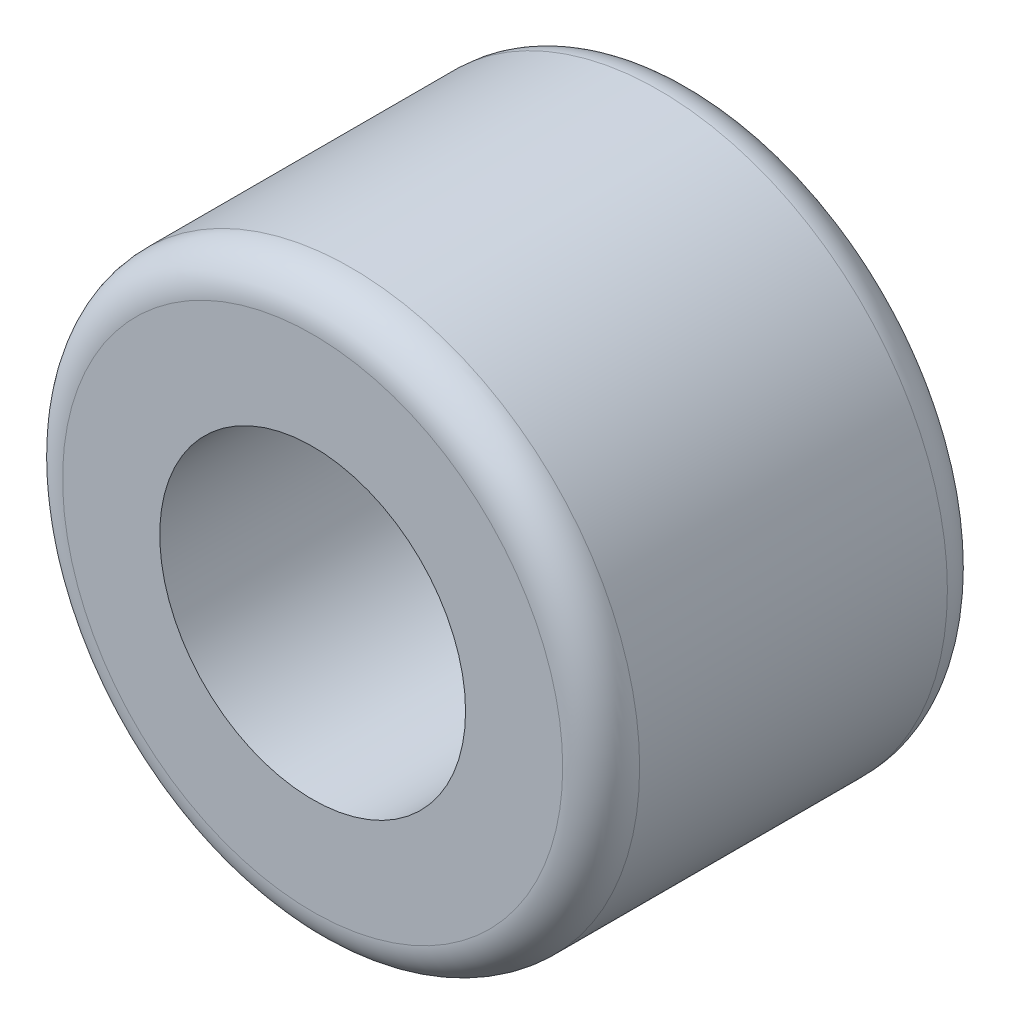
ISO-10303-21;
HEADER;
FILE_DESCRIPTION(('STEP AP214'),'2;1');
FILE_NAME('part.step','',(''),(''),'','','');
FILE_SCHEMA(('AUTOMOTIVE_DESIGN { 1 0 10303 214 1 1 1 1 }'));
ENDSEC;
DATA;
#1=APPLICATION_CONTEXT('core data for automotive mechanical design processes');
#2=APPLICATION_PROTOCOL_DEFINITION('international standard','automotive_design',2000,#1);
#3=PRODUCT_CONTEXT('',#1,'mechanical');
#4=PRODUCT('Part','Part','',(#3));
#5=PRODUCT_RELATED_PRODUCT_CATEGORY('part','',(#4));
#6=PRODUCT_DEFINITION_FORMATION('','',#4);
#7=PRODUCT_DEFINITION_CONTEXT('part definition',#1,'design');
#8=PRODUCT_DEFINITION('design','',#6,#7);
#9=PRODUCT_DEFINITION_SHAPE('','',#8);
#10=(LENGTH_UNIT() NAMED_UNIT(*) SI_UNIT(.MILLI.,.METRE.));
#11=(NAMED_UNIT(*) PLANE_ANGLE_UNIT() SI_UNIT($,.RADIAN.));
#12=(NAMED_UNIT(*) SI_UNIT($,.STERADIAN.) SOLID_ANGLE_UNIT());
#13=UNCERTAINTY_MEASURE_WITH_UNIT(LENGTH_MEASURE(1.E-05),#10,'distance_accuracy_value','');
#14=(GEOMETRIC_REPRESENTATION_CONTEXT(3) GLOBAL_UNCERTAINTY_ASSIGNED_CONTEXT((#13)) GLOBAL_UNIT_ASSIGNED_CONTEXT((#10,
#11,#12)) REPRESENTATION_CONTEXT('',''));
#15=CARTESIAN_POINT('',(0.,0.,0.));
#16=DIRECTION('',(0.,0.,1.));
#17=DIRECTION('',(1.,0.,0.));
#18=AXIS2_PLACEMENT_3D('',#15,#16,#17);
#19=CARTESIAN_POINT('',(0.,0.,5.));
#20=DIRECTION('',(0.,0.,1.));
#21=DIRECTION('',(1.,0.,0.));
#22=AXIS2_PLACEMENT_3D('',#19,#20,#21);
#23=PLANE('',#22);
#24=CARTESIAN_POINT('',(0.,0.,5.));
#25=DIRECTION('',(0.,0.,1.));
#26=DIRECTION('',(1.,0.,0.));
#27=AXIS2_PLACEMENT_3D('',#24,#25,#26);
#28=CIRCLE('',#27,6.5);
#29=CARTESIAN_POINT('',(6.5,0.,5.));
#30=VERTEX_POINT('',#29);
#31=EDGE_CURVE('E60',#30,#30,#28,.T.);
#32=ORIENTED_EDGE('',*,*,#31,.T.);
#33=EDGE_LOOP('',(#32));
#34=FACE_BOUND('',#33,.T.);
#35=CARTESIAN_POINT('',(0.,0.,5.));
#36=DIRECTION('',(0.,0.,1.));
#37=DIRECTION('',(1.,0.,0.));
#38=AXIS2_PLACEMENT_3D('',#35,#36,#37);
#39=CIRCLE('',#38,3.975);
#40=CARTESIAN_POINT('',(3.975,0.,5.));
#41=VERTEX_POINT('',#40);
#42=EDGE_CURVE('E66',#41,#41,#39,.T.);
#43=ORIENTED_EDGE('',*,*,#42,.F.);
#44=EDGE_LOOP('',(#43));
#45=FACE_BOUND('',#44,.T.);
#46=ADVANCED_FACE('F42',(#34,#45),#23,.T.);
#47=CARTESIAN_POINT('',(0.,0.,-5.));
#48=DIRECTION('',(0.,0.,1.));
#49=DIRECTION('',(1.,0.,0.));
#50=AXIS2_PLACEMENT_3D('',#47,#48,#49);
#51=PLANE('',#50);
#52=CARTESIAN_POINT('',(0.,0.,-5.));
#53=DIRECTION('',(0.,0.,1.));
#54=DIRECTION('',(1.,0.,0.));
#55=AXIS2_PLACEMENT_3D('',#52,#53,#54);
#56=CIRCLE('',#55,6.5);
#57=CARTESIAN_POINT('',(6.5,0.,-5.));
#58=VERTEX_POINT('',#57);
#59=EDGE_CURVE('E10',#58,#58,#56,.F.);
#60=ORIENTED_EDGE('',*,*,#59,.T.);
#61=EDGE_LOOP('',(#60));
#62=FACE_BOUND('',#61,.T.);
#63=CARTESIAN_POINT('',(0.,0.,-5.));
#64=DIRECTION('',(0.,0.,1.));
#65=DIRECTION('',(1.,0.,0.));
#66=AXIS2_PLACEMENT_3D('',#63,#64,#65);
#67=CIRCLE('',#66,3.975);
#68=CARTESIAN_POINT('',(3.975,0.,-5.));
#69=VERTEX_POINT('',#68);
#70=EDGE_CURVE('E67',#69,#69,#67,.T.);
#71=ORIENTED_EDGE('',*,*,#70,.T.);
#72=EDGE_LOOP('',(#71));
#73=FACE_BOUND('',#72,.T.);
#74=ADVANCED_FACE('F79',(#62,#73),#51,.F.);
#75=CARTESIAN_POINT('',(0.,0.,5.));
#76=DIRECTION('',(0.,0.,-1.));
#77=DIRECTION('',(-1.,0.,0.));
#78=AXIS2_PLACEMENT_3D('',#75,#76,#77);
#79=CYLINDRICAL_SURFACE('',#78,7.5);
#80=CARTESIAN_POINT('',(0.,0.,4.));
#81=DIRECTION('',(0.,0.,1.));
#82=DIRECTION('',(1.,0.,0.));
#83=AXIS2_PLACEMENT_3D('',#80,#81,#82);
#84=CIRCLE('',#83,7.5);
#85=CARTESIAN_POINT('',(7.5,0.,4.));
#86=VERTEX_POINT('',#85);
#87=EDGE_CURVE('E50',#86,#86,#84,.F.);
#88=ORIENTED_EDGE('',*,*,#87,.T.);
#89=EDGE_LOOP('',(#88));
#90=FACE_BOUND('',#89,.T.);
#91=CARTESIAN_POINT('',(0.,0.,-4.));
#92=DIRECTION('',(0.,0.,1.));
#93=DIRECTION('',(1.,0.,0.));
#94=AXIS2_PLACEMENT_3D('',#91,#92,#93);
#95=CIRCLE('',#94,7.5);
#96=CARTESIAN_POINT('',(7.5,0.,-4.));
#97=VERTEX_POINT('',#96);
#98=EDGE_CURVE('E55',#97,#97,#95,.T.);
#99=ORIENTED_EDGE('',*,*,#98,.T.);
#100=EDGE_LOOP('',(#99));
#101=FACE_BOUND('',#100,.T.);
#102=ADVANCED_FACE('F86',(#90,#101),#79,.T.);
#103=CARTESIAN_POINT('',(0.,0.,5.));
#104=DIRECTION('',(0.,0.,-1.));
#105=DIRECTION('',(-1.,0.,0.));
#106=AXIS2_PLACEMENT_3D('',#103,#104,#105);
#107=CYLINDRICAL_SURFACE('',#106,3.975);
#108=ORIENTED_EDGE('',*,*,#42,.T.);
#109=EDGE_LOOP('',(#108));
#110=FACE_BOUND('',#109,.T.);
#111=ORIENTED_EDGE('',*,*,#70,.F.);
#112=EDGE_LOOP('',(#111));
#113=FACE_BOUND('',#112,.T.);
#114=ADVANCED_FACE('F75',(#110,#113),#107,.F.);
#115=CARTESIAN_POINT('',(0.,0.,4.));
#116=DIRECTION('',(0.,0.,1.));
#117=DIRECTION('',(1.,0.,0.));
#118=AXIS2_PLACEMENT_3D('',#115,#116,#117);
#119=TOROIDAL_SURFACE('',#118,6.5,1.);
#120=ORIENTED_EDGE('',*,*,#87,.F.);
#121=EDGE_LOOP('',(#120));
#122=FACE_BOUND('',#121,.T.);
#123=ORIENTED_EDGE('',*,*,#31,.F.);
#124=EDGE_LOOP('',(#123));
#125=FACE_BOUND('',#124,.T.);
#126=ADVANCED_FACE('F91',(#122,#125),#119,.T.);
#127=CARTESIAN_POINT('',(0.,0.,-4.));
#128=DIRECTION('',(0.,0.,1.));
#129=DIRECTION('',(1.,0.,0.));
#130=AXIS2_PLACEMENT_3D('',#127,#128,#129);
#131=TOROIDAL_SURFACE('',#130,6.5,1.);
#132=ORIENTED_EDGE('',*,*,#59,.F.);
#133=EDGE_LOOP('',(#132));
#134=FACE_BOUND('',#133,.T.);
#135=ORIENTED_EDGE('',*,*,#98,.F.);
#136=EDGE_LOOP('',(#135));
#137=FACE_BOUND('',#136,.T.);
#138=ADVANCED_FACE('F44',(#134,#137),#131,.T.);
#139=CLOSED_SHELL('',(#46,#74,#102,#114,#126,#138));
#140=MANIFOLD_SOLID_BREP('B2',#139);
#141=ADVANCED_BREP_SHAPE_REPRESENTATION('',(#18,#140),#14);
#142=SHAPE_DEFINITION_REPRESENTATION(#9,#141);
ENDSEC;
END-ISO-10303-21;
